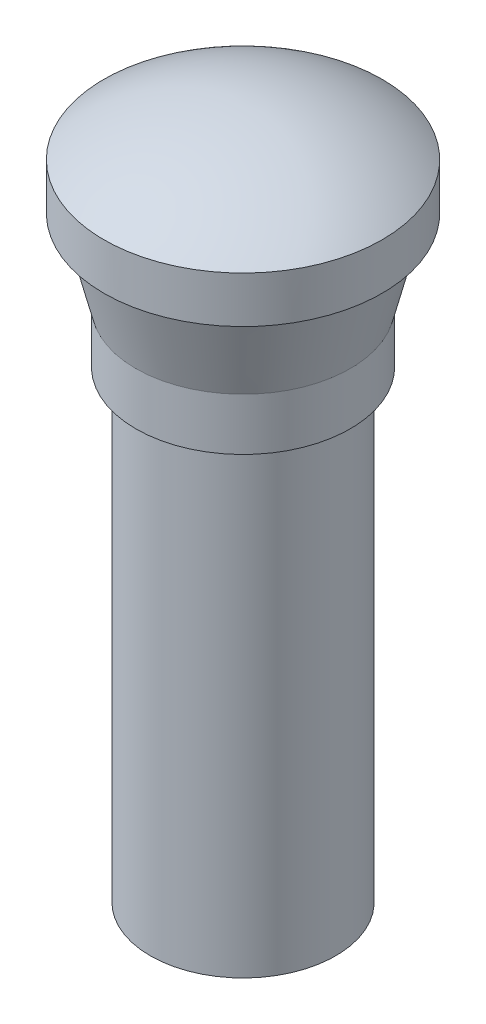
ISO-10303-21;
HEADER;
FILE_DESCRIPTION(('STEP AP214'),'2;1');
FILE_NAME('part.step','',(''),(''),'','','');
FILE_SCHEMA(('AUTOMOTIVE_DESIGN { 1 0 10303 214 1 1 1 1 }'));
ENDSEC;
DATA;
#1=APPLICATION_CONTEXT('core data for automotive mechanical design processes');
#2=APPLICATION_PROTOCOL_DEFINITION('international standard','automotive_design',2000,#1);
#3=PRODUCT_CONTEXT('',#1,'mechanical');
#4=PRODUCT('Part','Part','',(#3));
#5=PRODUCT_RELATED_PRODUCT_CATEGORY('part','',(#4));
#6=PRODUCT_DEFINITION_FORMATION('','',#4);
#7=PRODUCT_DEFINITION_CONTEXT('part definition',#1,'design');
#8=PRODUCT_DEFINITION('design','',#6,#7);
#9=PRODUCT_DEFINITION_SHAPE('','',#8);
#10=(LENGTH_UNIT() NAMED_UNIT(*) SI_UNIT(.MILLI.,.METRE.));
#11=(NAMED_UNIT(*) PLANE_ANGLE_UNIT() SI_UNIT($,.RADIAN.));
#12=(NAMED_UNIT(*) SI_UNIT($,.STERADIAN.) SOLID_ANGLE_UNIT());
#13=UNCERTAINTY_MEASURE_WITH_UNIT(LENGTH_MEASURE(1.E-05),#10,'distance_accuracy_value','');
#14=(GEOMETRIC_REPRESENTATION_CONTEXT(3) GLOBAL_UNCERTAINTY_ASSIGNED_CONTEXT((#13)) GLOBAL_UNIT_ASSIGNED_CONTEXT((#10,
#11,#12)) REPRESENTATION_CONTEXT('',''));
#15=CARTESIAN_POINT('',(0.,0.,0.));
#16=DIRECTION('',(0.,0.,1.));
#17=DIRECTION('',(1.,0.,0.));
#18=AXIS2_PLACEMENT_3D('',#15,#16,#17);
#19=CARTESIAN_POINT('',(0.,0.,0.));
#20=DIRECTION('',(0.,-1.,0.));
#21=DIRECTION('',(0.,0.,-1.));
#22=AXIS2_PLACEMENT_3D('',#19,#20,#21);
#23=PLANE('',#22);
#24=CARTESIAN_POINT('',(0.,0.,0.));
#25=DIRECTION('',(0.,-1.,0.));
#26=DIRECTION('',(0.,0.,-1.));
#27=AXIS2_PLACEMENT_3D('',#24,#25,#26);
#28=CIRCLE('',#27,8.);
#29=CARTESIAN_POINT('',(0.,0.,-8.));
#30=VERTEX_POINT('',#29);
#31=EDGE_CURVE('E10',#30,#30,#28,.T.);
#32=ORIENTED_EDGE('',*,*,#31,.T.);
#33=EDGE_LOOP('',(#32));
#34=FACE_BOUND('',#33,.T.);
#35=ADVANCED_FACE('F34',(#34),#23,.T.);
#36=CARTESIAN_POINT('',(0.,0.,0.));
#37=DIRECTION('',(0.,-1.,0.));
#38=DIRECTION('',(0.,0.,-1.));
#39=AXIS2_PLACEMENT_3D('',#36,#37,#38);
#40=CYLINDRICAL_SURFACE('',#39,8.);
#41=CARTESIAN_POINT('',(0.,40.,0.));
#42=DIRECTION('',(0.,-1.,0.));
#43=DIRECTION('',(0.,0.,-1.));
#44=AXIS2_PLACEMENT_3D('',#41,#42,#43);
#45=CIRCLE('',#44,8.);
#46=CARTESIAN_POINT('',(0.,40.,-8.));
#47=VERTEX_POINT('',#46);
#48=EDGE_CURVE('E40',#47,#47,#45,.T.);
#49=ORIENTED_EDGE('',*,*,#48,.T.);
#50=EDGE_LOOP('',(#49));
#51=FACE_BOUND('',#50,.T.);
#52=ORIENTED_EDGE('',*,*,#31,.F.);
#53=EDGE_LOOP('',(#52));
#54=FACE_BOUND('',#53,.T.);
#55=ADVANCED_FACE('F75',(#51,#54),#40,.T.);
#56=CARTESIAN_POINT('',(8.,40.,0.));
#57=DIRECTION('',(0.,-1.,0.));
#58=DIRECTION('',(0.,0.,-1.));
#59=AXIS2_PLACEMENT_3D('',#56,#57,#58);
#60=PLANE('',#59);
#61=CARTESIAN_POINT('',(0.,40.,0.));
#62=DIRECTION('',(0.,-1.,0.));
#63=DIRECTION('',(0.,0.,-1.));
#64=AXIS2_PLACEMENT_3D('',#61,#62,#63);
#65=CIRCLE('',#64,9.25);
#66=CARTESIAN_POINT('',(0.,40.,-9.25));
#67=VERTEX_POINT('',#66);
#68=EDGE_CURVE('E44',#67,#67,#65,.T.);
#69=ORIENTED_EDGE('',*,*,#68,.T.);
#70=EDGE_LOOP('',(#69));
#71=FACE_BOUND('',#70,.T.);
#72=ORIENTED_EDGE('',*,*,#48,.F.);
#73=EDGE_LOOP('',(#72));
#74=FACE_BOUND('',#73,.T.);
#75=ADVANCED_FACE('F79',(#71,#74),#60,.T.);
#76=CARTESIAN_POINT('',(0.,0.,0.));
#77=DIRECTION('',(0.,-1.,0.));
#78=DIRECTION('',(0.,0.,-1.));
#79=AXIS2_PLACEMENT_3D('',#76,#77,#78);
#80=CYLINDRICAL_SURFACE('',#79,9.25);
#81=CARTESIAN_POINT('',(0.,44.5,0.));
#82=DIRECTION('',(0.,-1.,0.));
#83=DIRECTION('',(0.,0.,-1.));
#84=AXIS2_PLACEMENT_3D('',#81,#82,#83);
#85=CIRCLE('',#84,9.25);
#86=CARTESIAN_POINT('',(0.,44.5,-9.25));
#87=VERTEX_POINT('',#86);
#88=EDGE_CURVE('E48',#87,#87,#85,.T.);
#89=ORIENTED_EDGE('',*,*,#88,.T.);
#90=EDGE_LOOP('',(#89));
#91=FACE_BOUND('',#90,.T.);
#92=ORIENTED_EDGE('',*,*,#68,.F.);
#93=EDGE_LOOP('',(#92));
#94=FACE_BOUND('',#93,.T.);
#95=ADVANCED_FACE('F83',(#91,#94),#80,.T.);
#96=CARTESIAN_POINT('',(0.,44.5,0.));
#97=DIRECTION('',(0.,1.,0.));
#98=DIRECTION('',(0.,0.,1.));
#99=AXIS2_PLACEMENT_3D('',#96,#97,#98);
#100=CONICAL_SURFACE('',#99,9.25,0.244978663126864);
#101=CARTESIAN_POINT('',(0.,51.5,0.));
#102=DIRECTION('',(0.,-1.,0.));
#103=DIRECTION('',(0.,0.,-1.));
#104=AXIS2_PLACEMENT_3D('',#101,#102,#103);
#105=CIRCLE('',#104,11.);
#106=CARTESIAN_POINT('',(0.,51.5,-11.));
#107=VERTEX_POINT('',#106);
#108=EDGE_CURVE('E53',#107,#107,#105,.T.);
#109=ORIENTED_EDGE('',*,*,#108,.T.);
#110=EDGE_LOOP('',(#109));
#111=FACE_BOUND('',#110,.T.);
#112=ORIENTED_EDGE('',*,*,#88,.F.);
#113=EDGE_LOOP('',(#112));
#114=FACE_BOUND('',#113,.T.);
#115=ADVANCED_FACE('F90',(#111,#114),#100,.T.);
#116=CARTESIAN_POINT('',(11.,51.5,0.));
#117=DIRECTION('',(0.,-1.,0.));
#118=DIRECTION('',(0.,0.,-1.));
#119=AXIS2_PLACEMENT_3D('',#116,#117,#118);
#120=PLANE('',#119);
#121=CARTESIAN_POINT('',(0.,51.5,0.));
#122=DIRECTION('',(0.,-1.,0.));
#123=DIRECTION('',(0.,0.,-1.));
#124=AXIS2_PLACEMENT_3D('',#121,#122,#123);
#125=CIRCLE('',#124,12.);
#126=CARTESIAN_POINT('',(0.,51.5,-12.));
#127=VERTEX_POINT('',#126);
#128=EDGE_CURVE('E56',#127,#127,#125,.T.);
#129=ORIENTED_EDGE('',*,*,#128,.T.);
#130=EDGE_LOOP('',(#129));
#131=FACE_BOUND('',#130,.T.);
#132=ORIENTED_EDGE('',*,*,#108,.F.);
#133=EDGE_LOOP('',(#132));
#134=FACE_BOUND('',#133,.T.);
#135=ADVANCED_FACE('F72',(#131,#134),#120,.T.);
#136=CARTESIAN_POINT('',(0.,0.,0.));
#137=DIRECTION('',(0.,-1.,0.));
#138=DIRECTION('',(0.,0.,-1.));
#139=AXIS2_PLACEMENT_3D('',#136,#137,#138);
#140=CYLINDRICAL_SURFACE('',#139,12.);
#141=CARTESIAN_POINT('',(0.,55.5,0.));
#142=DIRECTION('',(0.,-1.,0.));
#143=DIRECTION('',(0.,0.,-1.));
#144=AXIS2_PLACEMENT_3D('',#141,#142,#143);
#145=CIRCLE('',#144,12.);
#146=CARTESIAN_POINT('',(0.,55.5,-12.));
#147=VERTEX_POINT('',#146);
#148=EDGE_CURVE('E59',#147,#147,#145,.T.);
#149=ORIENTED_EDGE('',*,*,#148,.T.);
#150=EDGE_LOOP('',(#149));
#151=FACE_BOUND('',#150,.T.);
#152=ORIENTED_EDGE('',*,*,#128,.F.);
#153=EDGE_LOOP('',(#152));
#154=FACE_BOUND('',#153,.T.);
#155=ADVANCED_FACE('F63',(#151,#154),#140,.T.);
#156=CARTESIAN_POINT('',(0.,39.5,0.));
#157=DIRECTION('',(0.,-1.,0.));
#158=DIRECTION('',(1.,0.,0.));
#159=AXIS2_PLACEMENT_3D('',#156,#157,#158);
#160=SPHERICAL_SURFACE('',#159,20.);
#161=ORIENTED_EDGE('',*,*,#148,.F.);
#162=EDGE_LOOP('',(#161));
#163=FACE_BOUND('',#162,.T.);
#164=ADVANCED_FACE('F66',(#163),#160,.T.);
#165=CLOSED_SHELL('',(#35,#55,#75,#95,#115,#135,#155,#164));
#166=MANIFOLD_SOLID_BREP('B2',#165);
#167=ADVANCED_BREP_SHAPE_REPRESENTATION('',(#18,#166),#14);
#168=SHAPE_DEFINITION_REPRESENTATION(#9,#167);
ENDSEC;
END-ISO-10303-21;
